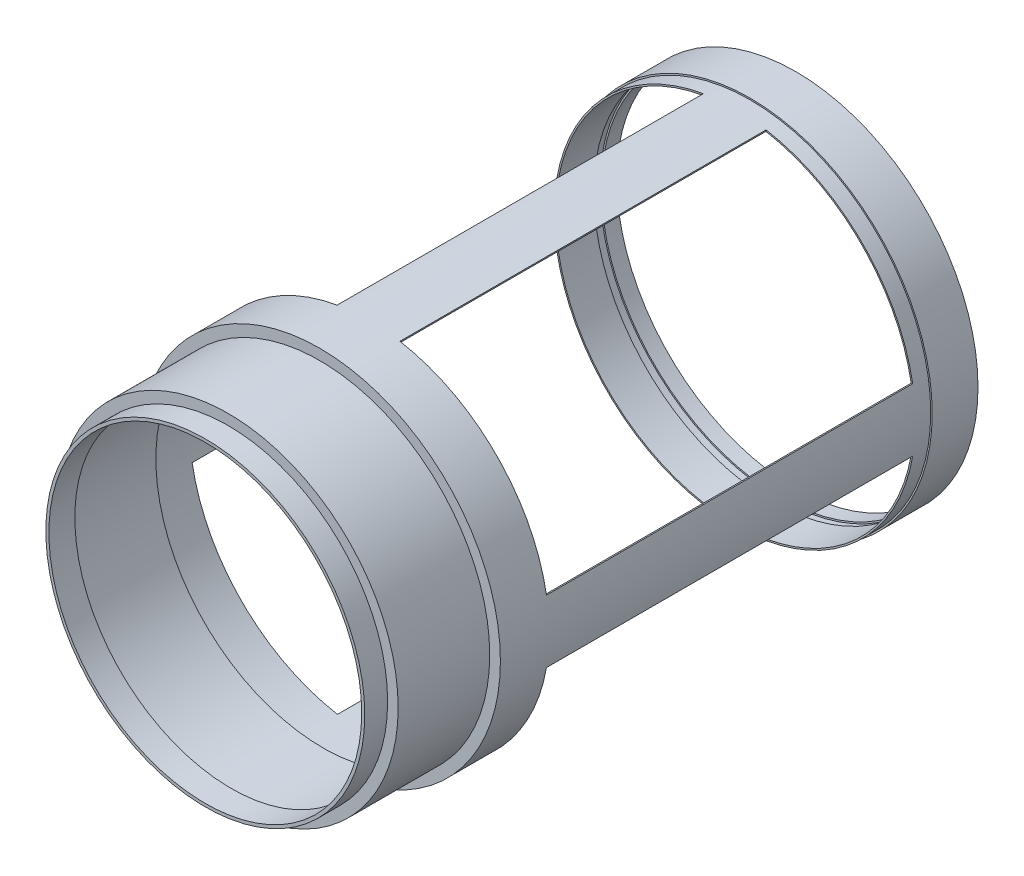
ISO-10303-21;
HEADER;
FILE_DESCRIPTION(('STEP AP214'),'2;1');
FILE_NAME('part.step','',(''),(''),'','','');
FILE_SCHEMA(('AUTOMOTIVE_DESIGN { 1 0 10303 214 1 1 1 1 }'));
ENDSEC;
DATA;
#1=APPLICATION_CONTEXT('core data for automotive mechanical design processes');
#2=APPLICATION_PROTOCOL_DEFINITION('international standard','automotive_design',2000,#1);
#3=PRODUCT_CONTEXT('',#1,'mechanical');
#4=PRODUCT('Part','Part','',(#3));
#5=PRODUCT_RELATED_PRODUCT_CATEGORY('part','',(#4));
#6=PRODUCT_DEFINITION_FORMATION('','',#4);
#7=PRODUCT_DEFINITION_CONTEXT('part definition',#1,'design');
#8=PRODUCT_DEFINITION('design','',#6,#7);
#9=PRODUCT_DEFINITION_SHAPE('','',#8);
#10=(LENGTH_UNIT() NAMED_UNIT(*) SI_UNIT(.MILLI.,.METRE.));
#11=(NAMED_UNIT(*) PLANE_ANGLE_UNIT() SI_UNIT($,.RADIAN.));
#12=(NAMED_UNIT(*) SI_UNIT($,.STERADIAN.) SOLID_ANGLE_UNIT());
#13=UNCERTAINTY_MEASURE_WITH_UNIT(LENGTH_MEASURE(1.E-05),#10,'distance_accuracy_value','');
#14=(GEOMETRIC_REPRESENTATION_CONTEXT(3) GLOBAL_UNCERTAINTY_ASSIGNED_CONTEXT((#13)) GLOBAL_UNIT_ASSIGNED_CONTEXT((#10,
#11,#12)) REPRESENTATION_CONTEXT('',''));
#15=CARTESIAN_POINT('',(0.,0.,0.));
#16=DIRECTION('',(0.,0.,1.));
#17=DIRECTION('',(1.,0.,0.));
#18=AXIS2_PLACEMENT_3D('',#15,#16,#17);
#19=CARTESIAN_POINT('',(0.,0.,372.));
#20=DIRECTION('',(0.,0.,1.));
#21=DIRECTION('',(1.,0.,0.));
#22=AXIS2_PLACEMENT_3D('',#19,#20,#21);
#23=PLANE('',#22);
#24=CARTESIAN_POINT('',(0.,0.,372.));
#25=DIRECTION('',(0.,0.,1.));
#26=DIRECTION('',(1.,0.,0.));
#27=AXIS2_PLACEMENT_3D('',#24,#25,#26);
#28=CIRCLE('',#27,111.4);
#29=CARTESIAN_POINT('',(111.4,0.,372.));
#30=VERTEX_POINT('',#29);
#31=EDGE_CURVE('E197',#30,#30,#28,.T.);
#32=ORIENTED_EDGE('',*,*,#31,.T.);
#33=EDGE_LOOP('',(#32));
#34=FACE_BOUND('',#33,.T.);
#35=CARTESIAN_POINT('',(0.,0.,372.));
#36=DIRECTION('',(0.,0.,1.));
#37=DIRECTION('',(1.,0.,0.));
#38=AXIS2_PLACEMENT_3D('',#35,#36,#37);
#39=CIRCLE('',#38,104.5);
#40=CARTESIAN_POINT('',(104.5,0.,372.));
#41=VERTEX_POINT('',#40);
#42=EDGE_CURVE('E210',#41,#41,#39,.T.);
#43=ORIENTED_EDGE('',*,*,#42,.F.);
#44=EDGE_LOOP('',(#43));
#45=FACE_BOUND('',#44,.T.);
#46=ADVANCED_FACE('F30',(#34,#45),#23,.T.);
#47=CARTESIAN_POINT('',(0.,0.,312.));
#48=DIRECTION('',(0.,0.,-1.));
#49=DIRECTION('',(-1.,0.,0.));
#50=AXIS2_PLACEMENT_3D('',#47,#48,#49);
#51=CYLINDRICAL_SURFACE('',#50,109.4);
#52=CARTESIAN_POINT('',(0.,0.,310.));
#53=DIRECTION('',(0.,0.,1.));
#54=DIRECTION('',(1.,0.,0.));
#55=AXIS2_PLACEMENT_3D('',#52,#53,#54);
#56=CIRCLE('',#55,109.4);
#57=CARTESIAN_POINT('',(109.4,0.,310.));
#58=VERTEX_POINT('',#57);
#59=EDGE_CURVE('E192',#58,#58,#56,.T.);
#60=ORIENTED_EDGE('',*,*,#59,.F.);
#61=EDGE_LOOP('',(#60));
#62=FACE_BOUND('',#61,.T.);
#63=CARTESIAN_POINT('',(0.,0.,370.));
#64=DIRECTION('',(0.,0.,1.));
#65=DIRECTION('',(1.,0.,0.));
#66=AXIS2_PLACEMENT_3D('',#63,#64,#65);
#67=CIRCLE('',#66,109.4);
#68=CARTESIAN_POINT('',(109.4,0.,370.));
#69=VERTEX_POINT('',#68);
#70=EDGE_CURVE('E201',#69,#69,#67,.T.);
#71=ORIENTED_EDGE('',*,*,#70,.T.);
#72=EDGE_LOOP('',(#71));
#73=FACE_BOUND('',#72,.T.);
#74=ADVANCED_FACE('F236',(#62,#73),#51,.F.);
#75=CARTESIAN_POINT('',(0.,0.,312.));
#76=DIRECTION('',(0.,0.,1.));
#77=DIRECTION('',(1.,0.,0.));
#78=AXIS2_PLACEMENT_3D('',#75,#76,#77);
#79=PLANE('',#78);
#80=CARTESIAN_POINT('',(0.,0.,312.));
#81=DIRECTION('',(0.,0.,1.));
#82=DIRECTION('',(1.,0.,0.));
#83=AXIS2_PLACEMENT_3D('',#80,#81,#82);
#84=CIRCLE('',#83,118.4);
#85=CARTESIAN_POINT('',(118.4,0.,312.));
#86=VERTEX_POINT('',#85);
#87=EDGE_CURVE('E189',#86,#86,#84,.T.);
#88=ORIENTED_EDGE('',*,*,#87,.T.);
#89=EDGE_LOOP('',(#88));
#90=FACE_BOUND('',#89,.T.);
#91=CARTESIAN_POINT('',(0.,0.,312.));
#92=DIRECTION('',(0.,0.,1.));
#93=DIRECTION('',(1.,0.,0.));
#94=AXIS2_PLACEMENT_3D('',#91,#92,#93);
#95=CIRCLE('',#94,111.4);
#96=CARTESIAN_POINT('',(111.4,0.,312.));
#97=VERTEX_POINT('',#96);
#98=EDGE_CURVE('E198',#97,#97,#95,.T.);
#99=ORIENTED_EDGE('',*,*,#98,.F.);
#100=EDGE_LOOP('',(#99));
#101=FACE_BOUND('',#100,.T.);
#102=ADVANCED_FACE('F242',(#90,#101),#79,.T.);
#103=CARTESIAN_POINT('',(0.,0.,40.));
#104=DIRECTION('',(0.,0.,1.));
#105=DIRECTION('',(1.,0.,0.));
#106=AXIS2_PLACEMENT_3D('',#103,#104,#105);
#107=PLANE('',#106);
#108=CARTESIAN_POINT('',(0.,0.,40.));
#109=DIRECTION('',(0.,0.,1.));
#110=DIRECTION('',(1.,0.,0.));
#111=AXIS2_PLACEMENT_3D('',#108,#109,#110);
#112=CIRCLE('',#111,117.4);
#113=CARTESIAN_POINT('',(-20.3862960580977,115.616430203633,40.));
#114=VERTEX_POINT('',#113);
#115=CARTESIAN_POINT('',(-115.616430203633,20.3862960580977,40.));
#116=VERTEX_POINT('',#115);
#117=EDGE_CURVE('E34',#114,#116,#112,.T.);
#118=ORIENTED_EDGE('',*,*,#117,.F.);
#119=DIRECTION('',(0.17364817766695,-0.984807753012205,0.));
#120=VECTOR('',#119,1.);
#121=CARTESIAN_POINT('',(-20.5599442357647,116.601237956645,40.));
#122=LINE('',#121,#120);
#123=CARTESIAN_POINT('',(-20.5599442357647,116.601237956645,40.));
#124=VERTEX_POINT('',#123);
#125=EDGE_CURVE('E469',#124,#114,#122,.T.);
#126=ORIENTED_EDGE('',*,*,#125,.F.);
#127=CARTESIAN_POINT('',(0.,0.,40.));
#128=DIRECTION('',(0.,0.,1.));
#129=DIRECTION('',(1.,0.,0.));
#130=AXIS2_PLACEMENT_3D('',#127,#128,#129);
#131=CIRCLE('',#130,118.4);
#132=CARTESIAN_POINT('',(-116.601237956645,20.5599442357646,40.));
#133=VERTEX_POINT('',#132);
#134=EDGE_CURVE('E352',#124,#133,#131,.T.);
#135=ORIENTED_EDGE('',*,*,#134,.T.);
#136=DIRECTION('',(-0.984807753012205,0.173648177666948,0.));
#137=VECTOR('',#136,1.);
#138=CARTESIAN_POINT('',(-115.616430203633,20.3862960580977,40.));
#139=LINE('',#138,#137);
#140=EDGE_CURVE('E455',#116,#133,#139,.T.);
#141=ORIENTED_EDGE('',*,*,#140,.F.);
#142=EDGE_LOOP('',(#118,#126,#135,#141));
#143=FACE_BOUND('',#142,.T.);
#144=ADVANCED_FACE('F255',(#143),#107,.T.);
#145=CARTESIAN_POINT('',(116.601237956645,20.5599442357647,40.));
#146=VERTEX_POINT('',#145);
#147=CARTESIAN_POINT('',(20.5599442357646,116.601237956645,40.));
#148=VERTEX_POINT('',#147);
#149=EDGE_CURVE('E349',#146,#148,#131,.T.);
#150=ORIENTED_EDGE('',*,*,#149,.T.);
#151=DIRECTION('',(0.17364817766693,0.984807753012208,0.));
#152=VECTOR('',#151,1.);
#153=CARTESIAN_POINT('',(20.5599442357646,116.601237956645,40.));
#154=LINE('',#153,#152);
#155=CARTESIAN_POINT('',(20.3862960580977,115.616430203633,40.));
#156=VERTEX_POINT('',#155);
#157=EDGE_CURVE('E55',#156,#148,#154,.T.);
#158=ORIENTED_EDGE('',*,*,#157,.F.);
#159=CARTESIAN_POINT('',(115.616430203633,20.3862960580977,40.));
#160=VERTEX_POINT('',#159);
#161=EDGE_CURVE('E164',#160,#156,#112,.T.);
#162=ORIENTED_EDGE('',*,*,#161,.F.);
#163=DIRECTION('',(-0.984807753012208,-0.17364817766693,0.));
#164=VECTOR('',#163,1.);
#165=CARTESIAN_POINT('',(116.601237956645,20.5599442357647,40.));
#166=LINE('',#165,#164);
#167=EDGE_CURVE('E369',#146,#160,#166,.T.);
#168=ORIENTED_EDGE('',*,*,#167,.F.);
#169=EDGE_LOOP('',(#150,#158,#162,#168));
#170=FACE_BOUND('',#169,.T.);
#171=ADVANCED_FACE('F489',(#170),#107,.T.);
#172=CARTESIAN_POINT('',(-115.616430203633,-20.3862960580977,40.));
#173=VERTEX_POINT('',#172);
#174=CARTESIAN_POINT('',(-20.3862960580977,-115.616430203633,40.));
#175=VERTEX_POINT('',#174);
#176=EDGE_CURVE('E366',#173,#175,#112,.T.);
#177=ORIENTED_EDGE('',*,*,#176,.F.);
#178=DIRECTION('',(0.984807753012208,0.173648177666933,0.));
#179=VECTOR('',#178,1.);
#180=CARTESIAN_POINT('',(-115.616430203633,-20.3862960580977,40.));
#181=LINE('',#180,#179);
#182=CARTESIAN_POINT('',(-116.601237956645,-20.5599442357647,40.));
#183=VERTEX_POINT('',#182);
#184=EDGE_CURVE('E451',#183,#173,#181,.T.);
#185=ORIENTED_EDGE('',*,*,#184,.F.);
#186=CARTESIAN_POINT('',(-20.5599442357646,-116.601237956645,40.));
#187=VERTEX_POINT('',#186);
#188=EDGE_CURVE('E363',#183,#187,#131,.T.);
#189=ORIENTED_EDGE('',*,*,#188,.T.);
#190=DIRECTION('',(-0.17364817766693,-0.984807753012208,0.));
#191=VECTOR('',#190,1.);
#192=CARTESIAN_POINT('',(-20.5599442357646,-116.601237956645,40.));
#193=LINE('',#192,#191);
#194=EDGE_CURVE('E430',#175,#187,#193,.T.);
#195=ORIENTED_EDGE('',*,*,#194,.F.);
#196=EDGE_LOOP('',(#177,#185,#189,#195));
#197=FACE_BOUND('',#196,.T.);
#198=ADVANCED_FACE('F299',(#197),#107,.T.);
#199=CARTESIAN_POINT('',(20.3862960580977,-115.616430203633,40.));
#200=VERTEX_POINT('',#199);
#201=CARTESIAN_POINT('',(115.616430203633,-20.3862960580977,40.));
#202=VERTEX_POINT('',#201);
#203=EDGE_CURVE('E365',#200,#202,#112,.T.);
#204=ORIENTED_EDGE('',*,*,#203,.F.);
#205=DIRECTION('',(-0.173648177666957,0.984807753012203,0.));
#206=VECTOR('',#205,1.);
#207=CARTESIAN_POINT('',(20.5599442357647,-116.601237956645,40.));
#208=LINE('',#207,#206);
#209=CARTESIAN_POINT('',(20.5599442357647,-116.601237956645,40.));
#210=VERTEX_POINT('',#209);
#211=EDGE_CURVE('E433',#210,#200,#208,.T.);
#212=ORIENTED_EDGE('',*,*,#211,.F.);
#213=CARTESIAN_POINT('',(116.601237956645,-20.5599442357646,40.));
#214=VERTEX_POINT('',#213);
#215=EDGE_CURVE('E359',#210,#214,#131,.T.);
#216=ORIENTED_EDGE('',*,*,#215,.T.);
#217=DIRECTION('',(0.984807753012208,-0.17364817766693,0.));
#218=VECTOR('',#217,1.);
#219=CARTESIAN_POINT('',(116.601237956645,-20.5599442357646,40.));
#220=LINE('',#219,#218);
#221=EDGE_CURVE('E376',#202,#214,#220,.T.);
#222=ORIENTED_EDGE('',*,*,#221,.F.);
#223=EDGE_LOOP('',(#204,#212,#216,#222));
#224=FACE_BOUND('',#223,.T.);
#225=ADVANCED_FACE('F295',(#224),#107,.T.);
#226=CARTESIAN_POINT('',(0.,0.,30.));
#227=DIRECTION('',(0.,0.,1.));
#228=DIRECTION('',(1.,0.,0.));
#229=AXIS2_PLACEMENT_3D('',#226,#227,#228);
#230=PLANE('',#229);
#231=CARTESIAN_POINT('',(0.,0.,30.));
#232=DIRECTION('',(0.,0.,1.));
#233=DIRECTION('',(1.,0.,0.));
#234=AXIS2_PLACEMENT_3D('',#231,#232,#233);
#235=CIRCLE('',#234,119.4);
#236=CARTESIAN_POINT('',(119.4,0.,30.));
#237=VERTEX_POINT('',#236);
#238=EDGE_CURVE('E345',#237,#237,#235,.T.);
#239=ORIENTED_EDGE('',*,*,#238,.T.);
#240=EDGE_LOOP('',(#239));
#241=FACE_BOUND('',#240,.T.);
#242=CARTESIAN_POINT('',(0.,0.,30.));
#243=DIRECTION('',(0.,0.,1.));
#244=DIRECTION('',(1.,0.,0.));
#245=AXIS2_PLACEMENT_3D('',#242,#243,#244);
#246=CIRCLE('',#245,118.4);
#247=CARTESIAN_POINT('',(118.4,0.,30.));
#248=VERTEX_POINT('',#247);
#249=EDGE_CURVE('E387',#248,#248,#246,.T.);
#250=ORIENTED_EDGE('',*,*,#249,.F.);
#251=EDGE_LOOP('',(#250));
#252=FACE_BOUND('',#251,.T.);
#253=ADVANCED_FACE('F298',(#241,#252),#230,.T.);
#254=CARTESIAN_POINT('',(0.,0.,10.));
#255=DIRECTION('',(0.,0.,1.));
#256=DIRECTION('',(1.,0.,0.));
#257=AXIS2_PLACEMENT_3D('',#254,#255,#256);
#258=PLANE('',#257);
#259=CARTESIAN_POINT('',(0.,0.,10.));
#260=DIRECTION('',(0.,0.,1.));
#261=DIRECTION('',(1.,0.,0.));
#262=AXIS2_PLACEMENT_3D('',#259,#260,#261);
#263=CIRCLE('',#262,118.4);
#264=CARTESIAN_POINT('',(118.4,0.,10.));
#265=VERTEX_POINT('',#264);
#266=EDGE_CURVE('E11',#265,#265,#263,.F.);
#267=ORIENTED_EDGE('',*,*,#266,.F.);
#268=EDGE_LOOP('',(#267));
#269=FACE_BOUND('',#268,.T.);
#270=CARTESIAN_POINT('',(0.,0.,10.));
#271=DIRECTION('',(0.,0.,1.));
#272=DIRECTION('',(1.,0.,0.));
#273=AXIS2_PLACEMENT_3D('',#270,#271,#272);
#274=CIRCLE('',#273,117.4);
#275=CARTESIAN_POINT('',(117.4,0.,10.));
#276=VERTEX_POINT('',#275);
#277=EDGE_CURVE('E339',#276,#276,#274,.T.);
#278=ORIENTED_EDGE('',*,*,#277,.F.);
#279=EDGE_LOOP('',(#278));
#280=FACE_BOUND('',#279,.T.);
#281=ADVANCED_FACE('F310',(#269,#280),#258,.T.);
#282=CARTESIAN_POINT('',(0.,0.,0.));
#283=DIRECTION('',(0.,0.,1.));
#284=DIRECTION('',(1.,0.,0.));
#285=AXIS2_PLACEMENT_3D('',#282,#283,#284);
#286=PLANE('',#285);
#287=CARTESIAN_POINT('',(0.,0.,0.));
#288=DIRECTION('',(0.,0.,1.));
#289=DIRECTION('',(1.,0.,0.));
#290=AXIS2_PLACEMENT_3D('',#287,#288,#289);
#291=CIRCLE('',#290,119.4);
#292=CARTESIAN_POINT('',(119.4,0.,0.));
#293=VERTEX_POINT('',#292);
#294=EDGE_CURVE('E40',#293,#293,#291,.T.);
#295=ORIENTED_EDGE('',*,*,#294,.F.);
#296=EDGE_LOOP('',(#295));
#297=FACE_BOUND('',#296,.T.);
#298=CARTESIAN_POINT('',(0.,0.,0.));
#299=DIRECTION('',(0.,0.,1.));
#300=DIRECTION('',(1.,0.,0.));
#301=AXIS2_PLACEMENT_3D('',#298,#299,#300);
#302=CIRCLE('',#301,117.4);
#303=CARTESIAN_POINT('',(117.4,0.,0.));
#304=VERTEX_POINT('',#303);
#305=EDGE_CURVE('E337',#304,#304,#302,.T.);
#306=ORIENTED_EDGE('',*,*,#305,.T.);
#307=EDGE_LOOP('',(#306));
#308=FACE_BOUND('',#307,.T.);
#309=ADVANCED_FACE('F324',(#297,#308),#286,.F.);
#310=CARTESIAN_POINT('',(0.,0.,10.));
#311=DIRECTION('',(0.,0.,-1.));
#312=DIRECTION('',(-1.,0.,0.));
#313=AXIS2_PLACEMENT_3D('',#310,#311,#312);
#314=CYLINDRICAL_SURFACE('',#313,119.4);
#315=ORIENTED_EDGE('',*,*,#294,.T.);
#316=EDGE_LOOP('',(#315));
#317=FACE_BOUND('',#316,.T.);
#318=ORIENTED_EDGE('',*,*,#238,.F.);
#319=EDGE_LOOP('',(#318));
#320=FACE_BOUND('',#319,.T.);
#321=ADVANCED_FACE('F32',(#317,#320),#314,.T.);
#322=CARTESIAN_POINT('',(0.,0.,10.));
#323=DIRECTION('',(0.,0.,-1.));
#324=DIRECTION('',(-1.,0.,0.));
#325=AXIS2_PLACEMENT_3D('',#322,#323,#324);
#326=CYLINDRICAL_SURFACE('',#325,117.4);
#327=ORIENTED_EDGE('',*,*,#277,.T.);
#328=EDGE_LOOP('',(#327));
#329=FACE_BOUND('',#328,.T.);
#330=ORIENTED_EDGE('',*,*,#305,.F.);
#331=EDGE_LOOP('',(#330));
#332=FACE_BOUND('',#331,.T.);
#333=ADVANCED_FACE('F318',(#329,#332),#326,.F.);
#334=CARTESIAN_POINT('',(0.,0.,15.));
#335=DIRECTION('',(0.,0.,-1.));
#336=DIRECTION('',(-1.,0.,0.));
#337=AXIS2_PLACEMENT_3D('',#334,#335,#336);
#338=CYLINDRICAL_SURFACE('',#337,118.4);
#339=CARTESIAN_POINT('',(0.,0.,15.));
#340=DIRECTION('',(0.,0.,1.));
#341=DIRECTION('',(1.,0.,0.));
#342=AXIS2_PLACEMENT_3D('',#339,#340,#341);
#343=CIRCLE('',#342,118.4);
#344=CARTESIAN_POINT('',(118.4,0.,15.));
#345=VERTEX_POINT('',#344);
#346=EDGE_CURVE('E340',#345,#345,#343,.T.);
#347=ORIENTED_EDGE('',*,*,#346,.T.);
#348=EDGE_LOOP('',(#347));
#349=FACE_BOUND('',#348,.T.);
#350=ORIENTED_EDGE('',*,*,#266,.T.);
#351=EDGE_LOOP('',(#350));
#352=FACE_BOUND('',#351,.T.);
#353=ADVANCED_FACE('F314',(#349,#352),#338,.F.);
#354=CARTESIAN_POINT('',(0.,0.,15.));
#355=DIRECTION('',(0.,0.,1.));
#356=DIRECTION('',(1.,0.,0.));
#357=AXIS2_PLACEMENT_3D('',#354,#355,#356);
#358=PLANE('',#357);
#359=ORIENTED_EDGE('',*,*,#346,.F.);
#360=EDGE_LOOP('',(#359));
#361=FACE_BOUND('',#360,.T.);
#362=CARTESIAN_POINT('',(0.,0.,15.));
#363=DIRECTION('',(0.,0.,1.));
#364=DIRECTION('',(1.,0.,0.));
#365=AXIS2_PLACEMENT_3D('',#362,#363,#364);
#366=CIRCLE('',#365,117.4);
#367=CARTESIAN_POINT('',(117.4,0.,15.));
#368=VERTEX_POINT('',#367);
#369=EDGE_CURVE('E351',#368,#368,#366,.T.);
#370=ORIENTED_EDGE('',*,*,#369,.T.);
#371=EDGE_LOOP('',(#370));
#372=FACE_BOUND('',#371,.T.);
#373=ADVANCED_FACE('F306',(#361,#372),#358,.F.);
#374=CARTESIAN_POINT('',(0.,0.,30.));
#375=DIRECTION('',(0.,0.,-1.));
#376=DIRECTION('',(-1.,0.,0.));
#377=AXIS2_PLACEMENT_3D('',#374,#375,#376);
#378=CYLINDRICAL_SURFACE('',#377,117.4);
#379=DIRECTION('',(0.,0.,-1.));
#380=VECTOR('',#379,1.);
#381=CARTESIAN_POINT('',(115.616430203633,-20.3862960580977,280.));
#382=LINE('',#381,#380);
#383=CARTESIAN_POINT('',(115.616430203633,-20.3862960580977,280.));
#384=VERTEX_POINT('',#383);
#385=EDGE_CURVE('E398',#384,#202,#382,.T.);
#386=ORIENTED_EDGE('',*,*,#385,.F.);
#387=CARTESIAN_POINT('',(0.,0.,280.));
#388=DIRECTION('',(0.,0.,1.));
#389=DIRECTION('',(1.,0.,0.));
#390=AXIS2_PLACEMENT_3D('',#387,#388,#389);
#391=CIRCLE('',#390,117.4);
#392=CARTESIAN_POINT('',(20.3862960580977,-115.616430203633,280.));
#393=VERTEX_POINT('',#392);
#394=EDGE_CURVE('E173',#393,#384,#391,.T.);
#395=ORIENTED_EDGE('',*,*,#394,.F.);
#396=DIRECTION('',(0.,0.,-1.));
#397=VECTOR('',#396,1.);
#398=CARTESIAN_POINT('',(20.3862960580977,-115.616430203633,280.));
#399=LINE('',#398,#397);
#400=EDGE_CURVE('E411',#393,#200,#399,.T.);
#401=ORIENTED_EDGE('',*,*,#400,.T.);
#402=ORIENTED_EDGE('',*,*,#203,.T.);
#403=EDGE_LOOP('',(#386,#395,#401,#402));
#404=FACE_BOUND('',#403,.T.);
#405=DIRECTION('',(0.,0.,-1.));
#406=VECTOR('',#405,1.);
#407=CARTESIAN_POINT('',(-20.3862960580977,-115.616430203633,280.));
#408=LINE('',#407,#406);
#409=CARTESIAN_POINT('',(-20.3862960580977,-115.616430203633,280.));
#410=VERTEX_POINT('',#409);
#411=EDGE_CURVE('E423',#410,#175,#408,.T.);
#412=ORIENTED_EDGE('',*,*,#411,.F.);
#413=CARTESIAN_POINT('',(-115.616430203633,-20.3862960580977,280.));
#414=VERTEX_POINT('',#413);
#415=EDGE_CURVE('E179',#414,#410,#391,.T.);
#416=ORIENTED_EDGE('',*,*,#415,.F.);
#417=DIRECTION('',(0.,0.,-1.));
#418=VECTOR('',#417,1.);
#419=CARTESIAN_POINT('',(-115.616430203633,-20.3862960580977,280.));
#420=LINE('',#419,#418);
#421=EDGE_CURVE('E447',#414,#173,#420,.T.);
#422=ORIENTED_EDGE('',*,*,#421,.T.);
#423=ORIENTED_EDGE('',*,*,#176,.T.);
#424=EDGE_LOOP('',(#412,#416,#422,#423));
#425=FACE_BOUND('',#424,.T.);
#426=DIRECTION('',(0.,0.,-1.));
#427=VECTOR('',#426,1.);
#428=CARTESIAN_POINT('',(-115.616430203633,20.3862960580977,280.));
#429=LINE('',#428,#427);
#430=CARTESIAN_POINT('',(-115.616430203633,20.3862960580977,280.));
#431=VERTEX_POINT('',#430);
#432=EDGE_CURVE('E435',#431,#116,#429,.T.);
#433=ORIENTED_EDGE('',*,*,#432,.F.);
#434=CARTESIAN_POINT('',(-20.3862960580977,115.616430203633,280.));
#435=VERTEX_POINT('',#434);
#436=EDGE_CURVE('E171',#435,#431,#391,.T.);
#437=ORIENTED_EDGE('',*,*,#436,.F.);
#438=DIRECTION('',(0.,0.,-1.));
#439=VECTOR('',#438,1.);
#440=CARTESIAN_POINT('',(-20.3862960580977,115.616430203633,280.));
#441=LINE('',#440,#439);
#442=EDGE_CURVE('E165',#435,#114,#441,.T.);
#443=ORIENTED_EDGE('',*,*,#442,.T.);
#444=ORIENTED_EDGE('',*,*,#117,.T.);
#445=EDGE_LOOP('',(#433,#437,#443,#444));
#446=FACE_BOUND('',#445,.T.);
#447=ORIENTED_EDGE('',*,*,#369,.F.);
#448=EDGE_LOOP('',(#447));
#449=FACE_BOUND('',#448,.T.);
#450=ORIENTED_EDGE('',*,*,#161,.T.);
#451=DIRECTION('',(0.,0.,-1.));
#452=VECTOR('',#451,1.);
#453=CARTESIAN_POINT('',(20.3862960580977,115.616430203633,280.));
#454=LINE('',#453,#452);
#455=CARTESIAN_POINT('',(20.3862960580977,115.616430203633,280.));
#456=VERTEX_POINT('',#455);
#457=EDGE_CURVE('E149',#456,#156,#454,.T.);
#458=ORIENTED_EDGE('',*,*,#457,.F.);
#459=CARTESIAN_POINT('',(115.616430203633,20.3862960580977,280.));
#460=VERTEX_POINT('',#459);
#461=EDGE_CURVE('E163',#460,#456,#391,.T.);
#462=ORIENTED_EDGE('',*,*,#461,.F.);
#463=DIRECTION('',(0.,0.,-1.));
#464=VECTOR('',#463,1.);
#465=CARTESIAN_POINT('',(115.616430203633,20.3862960580977,280.));
#466=LINE('',#465,#464);
#467=EDGE_CURVE('E378',#460,#160,#466,.T.);
#468=ORIENTED_EDGE('',*,*,#467,.T.);
#469=EDGE_LOOP('',(#450,#458,#462,#468));
#470=FACE_BOUND('',#469,.T.);
#471=CARTESIAN_POINT('',(0.,0.,310.));
#472=DIRECTION('',(0.,0.,1.));
#473=DIRECTION('',(1.,0.,0.));
#474=AXIS2_PLACEMENT_3D('',#471,#472,#473);
#475=CIRCLE('',#474,117.4);
#476=CARTESIAN_POINT('',(117.4,0.,310.));
#477=VERTEX_POINT('',#476);
#478=EDGE_CURVE('E182',#477,#477,#475,.T.);
#479=ORIENTED_EDGE('',*,*,#478,.T.);
#480=EDGE_LOOP('',(#479));
#481=FACE_BOUND('',#480,.T.);
#482=ADVANCED_FACE('F160',(#404,#425,#446,#449,#470,#481),#378,.F.);
#483=CARTESIAN_POINT('',(0.,0.,40.));
#484=DIRECTION('',(0.,0.,-1.));
#485=DIRECTION('',(-1.,0.,0.));
#486=AXIS2_PLACEMENT_3D('',#483,#484,#485);
#487=CYLINDRICAL_SURFACE('',#486,118.4);
#488=DIRECTION('',(0.,0.,-1.));
#489=VECTOR('',#488,1.);
#490=CARTESIAN_POINT('',(116.601237956645,20.5599442357647,280.));
#491=LINE('',#490,#489);
#492=CARTESIAN_POINT('',(116.601237956645,20.5599442357647,280.));
#493=VERTEX_POINT('',#492);
#494=EDGE_CURVE('E404',#493,#146,#491,.T.);
#495=ORIENTED_EDGE('',*,*,#494,.F.);
#496=CARTESIAN_POINT('',(0.,0.,280.));
#497=DIRECTION('',(0.,0.,1.));
#498=DIRECTION('',(1.,0.,0.));
#499=AXIS2_PLACEMENT_3D('',#496,#497,#498);
#500=CIRCLE('',#499,118.4);
#501=CARTESIAN_POINT('',(20.5599442357646,116.601237956645,280.));
#502=VERTEX_POINT('',#501);
#503=EDGE_CURVE('E177',#493,#502,#500,.T.);
#504=ORIENTED_EDGE('',*,*,#503,.T.);
#505=DIRECTION('',(0.,0.,-1.));
#506=VECTOR('',#505,1.);
#507=CARTESIAN_POINT('',(20.5599442357646,116.601237956645,280.));
#508=LINE('',#507,#506);
#509=EDGE_CURVE('E151',#502,#148,#508,.T.);
#510=ORIENTED_EDGE('',*,*,#509,.T.);
#511=ORIENTED_EDGE('',*,*,#149,.F.);
#512=EDGE_LOOP('',(#495,#504,#510,#511));
#513=FACE_BOUND('',#512,.T.);
#514=DIRECTION('',(0.,0.,-1.));
#515=VECTOR('',#514,1.);
#516=CARTESIAN_POINT('',(20.5599442357647,-116.601237956645,280.));
#517=LINE('',#516,#515);
#518=CARTESIAN_POINT('',(20.5599442357647,-116.601237956645,280.));
#519=VERTEX_POINT('',#518);
#520=EDGE_CURVE('E377',#519,#210,#517,.T.);
#521=ORIENTED_EDGE('',*,*,#520,.F.);
#522=CARTESIAN_POINT('',(116.601237956645,-20.5599442357646,280.));
#523=VERTEX_POINT('',#522);
#524=EDGE_CURVE('E170',#519,#523,#500,.T.);
#525=ORIENTED_EDGE('',*,*,#524,.T.);
#526=DIRECTION('',(0.,0.,-1.));
#527=VECTOR('',#526,1.);
#528=CARTESIAN_POINT('',(116.601237956645,-20.5599442357646,280.));
#529=LINE('',#528,#527);
#530=EDGE_CURVE('E395',#523,#214,#529,.T.);
#531=ORIENTED_EDGE('',*,*,#530,.T.);
#532=ORIENTED_EDGE('',*,*,#215,.F.);
#533=EDGE_LOOP('',(#521,#525,#531,#532));
#534=FACE_BOUND('',#533,.T.);
#535=DIRECTION('',(0.,0.,-1.));
#536=VECTOR('',#535,1.);
#537=CARTESIAN_POINT('',(-116.601237956645,-20.5599442357647,280.));
#538=LINE('',#537,#536);
#539=CARTESIAN_POINT('',(-116.601237956645,-20.5599442357647,280.));
#540=VERTEX_POINT('',#539);
#541=EDGE_CURVE('E444',#540,#183,#538,.T.);
#542=ORIENTED_EDGE('',*,*,#541,.F.);
#543=CARTESIAN_POINT('',(-20.5599442357646,-116.601237956645,280.));
#544=VERTEX_POINT('',#543);
#545=EDGE_CURVE('E175',#540,#544,#500,.T.);
#546=ORIENTED_EDGE('',*,*,#545,.T.);
#547=DIRECTION('',(0.,0.,-1.));
#548=VECTOR('',#547,1.);
#549=CARTESIAN_POINT('',(-20.5599442357646,-116.601237956645,280.));
#550=LINE('',#549,#548);
#551=EDGE_CURVE('E426',#544,#187,#550,.T.);
#552=ORIENTED_EDGE('',*,*,#551,.T.);
#553=ORIENTED_EDGE('',*,*,#188,.F.);
#554=EDGE_LOOP('',(#542,#546,#552,#553));
#555=FACE_BOUND('',#554,.T.);
#556=CARTESIAN_POINT('',(-20.5599442357647,116.601237956645,280.));
#557=VERTEX_POINT('',#556);
#558=CARTESIAN_POINT('',(-116.601237956645,20.5599442357646,280.));
#559=VERTEX_POINT('',#558);
#560=EDGE_CURVE('E472',#557,#559,#500,.T.);
#561=ORIENTED_EDGE('',*,*,#560,.T.);
#562=DIRECTION('',(0.,0.,-1.));
#563=VECTOR('',#562,1.);
#564=CARTESIAN_POINT('',(-116.601237956645,20.5599442357646,280.));
#565=LINE('',#564,#563);
#566=EDGE_CURVE('E441',#559,#133,#565,.T.);
#567=ORIENTED_EDGE('',*,*,#566,.T.);
#568=ORIENTED_EDGE('',*,*,#134,.F.);
#569=DIRECTION('',(0.,0.,-1.));
#570=VECTOR('',#569,1.);
#571=CARTESIAN_POINT('',(-20.5599442357647,116.601237956645,280.));
#572=LINE('',#571,#570);
#573=EDGE_CURVE('E458',#557,#124,#572,.T.);
#574=ORIENTED_EDGE('',*,*,#573,.F.);
#575=EDGE_LOOP('',(#561,#567,#568,#574));
#576=FACE_BOUND('',#575,.T.);
#577=ORIENTED_EDGE('',*,*,#249,.T.);
#578=EDGE_LOOP('',(#577));
#579=FACE_BOUND('',#578,.T.);
#580=ORIENTED_EDGE('',*,*,#87,.F.);
#581=EDGE_LOOP('',(#580));
#582=FACE_BOUND('',#581,.T.);
#583=ADVANCED_FACE('F293',(#513,#534,#555,#576,#579,#582),#487,.T.);
#584=CARTESIAN_POINT('',(116.601237956645,20.5599442357647,280.));
#585=DIRECTION('',(0.17364817766693,-0.984807753012208,0.));
#586=DIRECTION('',(0.984807753012208,0.17364817766693,0.));
#587=AXIS2_PLACEMENT_3D('',#584,#585,#586);
#588=PLANE('',#587);
#589=ORIENTED_EDGE('',*,*,#167,.T.);
#590=ORIENTED_EDGE('',*,*,#467,.F.);
#591=DIRECTION('',(-0.984807753012208,-0.17364817766693,0.));
#592=VECTOR('',#591,1.);
#593=CARTESIAN_POINT('',(116.601237956645,20.5599442357647,280.));
#594=LINE('',#593,#592);
#595=EDGE_CURVE('E169',#493,#460,#594,.T.);
#596=ORIENTED_EDGE('',*,*,#595,.F.);
#597=ORIENTED_EDGE('',*,*,#494,.T.);
#598=EDGE_LOOP('',(#589,#590,#596,#597));
#599=FACE_BOUND('',#598,.T.);
#600=ADVANCED_FACE('F289',(#599),#588,.F.);
#601=CARTESIAN_POINT('',(116.601237956645,-20.5599442357646,280.));
#602=DIRECTION('',(0.17364817766693,0.984807753012208,0.));
#603=DIRECTION('',(-0.984807753012208,0.17364817766693,0.));
#604=AXIS2_PLACEMENT_3D('',#601,#602,#603);
#605=PLANE('',#604);
#606=ORIENTED_EDGE('',*,*,#221,.T.);
#607=ORIENTED_EDGE('',*,*,#530,.F.);
#608=DIRECTION('',(0.984807753012208,-0.17364817766693,0.));
#609=VECTOR('',#608,1.);
#610=CARTESIAN_POINT('',(116.601237956645,-20.5599442357646,280.));
#611=LINE('',#610,#609);
#612=EDGE_CURVE('E383',#384,#523,#611,.T.);
#613=ORIENTED_EDGE('',*,*,#612,.F.);
#614=ORIENTED_EDGE('',*,*,#385,.T.);
#615=EDGE_LOOP('',(#606,#607,#613,#614));
#616=FACE_BOUND('',#615,.T.);
#617=ADVANCED_FACE('F285',(#616),#605,.F.);
#618=CARTESIAN_POINT('',(20.5599442357647,-116.601237956645,280.));
#619=DIRECTION('',(-0.984807753012203,-0.173648177666957,0.));
#620=DIRECTION('',(0.173648177666957,-0.984807753012204,0.));
#621=AXIS2_PLACEMENT_3D('',#618,#619,#620);
#622=PLANE('',#621);
#623=ORIENTED_EDGE('',*,*,#211,.T.);
#624=ORIENTED_EDGE('',*,*,#400,.F.);
#625=DIRECTION('',(-0.173648177666957,0.984807753012203,0.));
#626=VECTOR('',#625,1.);
#627=CARTESIAN_POINT('',(20.5599442357647,-116.601237956645,280.));
#628=LINE('',#627,#626);
#629=EDGE_CURVE('E419',#519,#393,#628,.T.);
#630=ORIENTED_EDGE('',*,*,#629,.F.);
#631=ORIENTED_EDGE('',*,*,#520,.T.);
#632=EDGE_LOOP('',(#623,#624,#630,#631));
#633=FACE_BOUND('',#632,.T.);
#634=ADVANCED_FACE('F281',(#633),#622,.F.);
#635=CARTESIAN_POINT('',(-20.5599442357646,-116.601237956645,280.));
#636=DIRECTION('',(0.984807753012208,-0.17364817766693,0.));
#637=DIRECTION('',(0.17364817766693,0.984807753012208,0.));
#638=AXIS2_PLACEMENT_3D('',#635,#636,#637);
#639=PLANE('',#638);
#640=ORIENTED_EDGE('',*,*,#194,.T.);
#641=ORIENTED_EDGE('',*,*,#551,.F.);
#642=DIRECTION('',(-0.17364817766693,-0.984807753012208,0.));
#643=VECTOR('',#642,1.);
#644=CARTESIAN_POINT('',(-20.5599442357646,-116.601237956645,280.));
#645=LINE('',#644,#643);
#646=EDGE_CURVE('E429',#410,#544,#645,.T.);
#647=ORIENTED_EDGE('',*,*,#646,.F.);
#648=ORIENTED_EDGE('',*,*,#411,.T.);
#649=EDGE_LOOP('',(#640,#641,#647,#648));
#650=FACE_BOUND('',#649,.T.);
#651=ADVANCED_FACE('F277',(#650),#639,.F.);
#652=CARTESIAN_POINT('',(-115.616430203633,20.3862960580977,280.));
#653=DIRECTION('',(-0.173648177666948,-0.984807753012205,0.));
#654=DIRECTION('',(0.984807753012205,-0.173648177666948,0.));
#655=AXIS2_PLACEMENT_3D('',#652,#653,#654);
#656=PLANE('',#655);
#657=ORIENTED_EDGE('',*,*,#140,.T.);
#658=ORIENTED_EDGE('',*,*,#566,.F.);
#659=DIRECTION('',(-0.984807753012205,0.173648177666948,0.));
#660=VECTOR('',#659,1.);
#661=CARTESIAN_POINT('',(-115.616430203633,20.3862960580977,280.));
#662=LINE('',#661,#660);
#663=EDGE_CURVE('E454',#431,#559,#662,.T.);
#664=ORIENTED_EDGE('',*,*,#663,.F.);
#665=ORIENTED_EDGE('',*,*,#432,.T.);
#666=EDGE_LOOP('',(#657,#658,#664,#665));
#667=FACE_BOUND('',#666,.T.);
#668=ADVANCED_FACE('F273',(#667),#656,.F.);
#669=CARTESIAN_POINT('',(-115.616430203633,-20.3862960580977,280.));
#670=DIRECTION('',(-0.173648177666933,0.984807753012207,0.));
#671=DIRECTION('',(-0.984807753012208,-0.173648177666933,0.));
#672=AXIS2_PLACEMENT_3D('',#669,#670,#671);
#673=PLANE('',#672);
#674=ORIENTED_EDGE('',*,*,#184,.T.);
#675=ORIENTED_EDGE('',*,*,#421,.F.);
#676=DIRECTION('',(0.984807753012208,0.173648177666933,0.));
#677=VECTOR('',#676,1.);
#678=CARTESIAN_POINT('',(-115.616430203633,-20.3862960580977,280.));
#679=LINE('',#678,#677);
#680=EDGE_CURVE('E450',#540,#414,#679,.T.);
#681=ORIENTED_EDGE('',*,*,#680,.F.);
#682=ORIENTED_EDGE('',*,*,#541,.T.);
#683=EDGE_LOOP('',(#674,#675,#681,#682));
#684=FACE_BOUND('',#683,.T.);
#685=ADVANCED_FACE('F269',(#684),#673,.F.);
#686=CARTESIAN_POINT('',(-20.5599442357647,116.601237956645,280.));
#687=DIRECTION('',(0.984807753012205,0.17364817766695,0.));
#688=DIRECTION('',(-0.17364817766695,0.984807753012205,0.));
#689=AXIS2_PLACEMENT_3D('',#686,#687,#688);
#690=PLANE('',#689);
#691=ORIENTED_EDGE('',*,*,#125,.T.);
#692=ORIENTED_EDGE('',*,*,#442,.F.);
#693=DIRECTION('',(0.17364817766695,-0.984807753012205,0.));
#694=VECTOR('',#693,1.);
#695=CARTESIAN_POINT('',(-20.5599442357647,116.601237956645,280.));
#696=LINE('',#695,#694);
#697=EDGE_CURVE('E156',#557,#435,#696,.T.);
#698=ORIENTED_EDGE('',*,*,#697,.F.);
#699=ORIENTED_EDGE('',*,*,#573,.T.);
#700=EDGE_LOOP('',(#691,#692,#698,#699));
#701=FACE_BOUND('',#700,.T.);
#702=ADVANCED_FACE('F266',(#701),#690,.F.);
#703=CARTESIAN_POINT('',(20.5599442357646,116.601237956645,280.));
#704=DIRECTION('',(-0.984807753012208,0.17364817766693,0.));
#705=DIRECTION('',(-0.17364817766693,-0.984807753012208,0.));
#706=AXIS2_PLACEMENT_3D('',#703,#704,#705);
#707=PLANE('',#706);
#708=ORIENTED_EDGE('',*,*,#157,.T.);
#709=ORIENTED_EDGE('',*,*,#509,.F.);
#710=DIRECTION('',(0.17364817766693,0.984807753012208,0.));
#711=VECTOR('',#710,1.);
#712=CARTESIAN_POINT('',(20.5599442357646,116.601237956645,280.));
#713=LINE('',#712,#711);
#714=EDGE_CURVE('E146',#456,#502,#713,.T.);
#715=ORIENTED_EDGE('',*,*,#714,.F.);
#716=ORIENTED_EDGE('',*,*,#457,.T.);
#717=EDGE_LOOP('',(#708,#709,#715,#716));
#718=FACE_BOUND('',#717,.T.);
#719=ADVANCED_FACE('F148',(#718),#707,.F.);
#720=CARTESIAN_POINT('',(0.,0.,280.));
#721=DIRECTION('',(0.,0.,1.));
#722=DIRECTION('',(1.,0.,0.));
#723=AXIS2_PLACEMENT_3D('',#720,#721,#722);
#724=PLANE('',#723);
#725=ORIENTED_EDGE('',*,*,#503,.F.);
#726=ORIENTED_EDGE('',*,*,#595,.T.);
#727=ORIENTED_EDGE('',*,*,#461,.T.);
#728=ORIENTED_EDGE('',*,*,#714,.T.);
#729=EDGE_LOOP('',(#725,#726,#727,#728));
#730=FACE_BOUND('',#729,.T.);
#731=ADVANCED_FACE('F168',(#730),#724,.F.);
#732=ORIENTED_EDGE('',*,*,#394,.T.);
#733=ORIENTED_EDGE('',*,*,#612,.T.);
#734=ORIENTED_EDGE('',*,*,#524,.F.);
#735=ORIENTED_EDGE('',*,*,#629,.T.);
#736=EDGE_LOOP('',(#732,#733,#734,#735));
#737=FACE_BOUND('',#736,.T.);
#738=ADVANCED_FACE('F263',(#737),#724,.F.);
#739=ORIENTED_EDGE('',*,*,#415,.T.);
#740=ORIENTED_EDGE('',*,*,#646,.T.);
#741=ORIENTED_EDGE('',*,*,#545,.F.);
#742=ORIENTED_EDGE('',*,*,#680,.T.);
#743=EDGE_LOOP('',(#739,#740,#741,#742));
#744=FACE_BOUND('',#743,.T.);
#745=ADVANCED_FACE('F481',(#744),#724,.F.);
#746=ORIENTED_EDGE('',*,*,#436,.T.);
#747=ORIENTED_EDGE('',*,*,#663,.T.);
#748=ORIENTED_EDGE('',*,*,#560,.F.);
#749=ORIENTED_EDGE('',*,*,#697,.T.);
#750=EDGE_LOOP('',(#746,#747,#748,#749));
#751=FACE_BOUND('',#750,.T.);
#752=ADVANCED_FACE('F259',(#751),#724,.F.);
#753=CARTESIAN_POINT('',(0.,0.,310.));
#754=DIRECTION('',(0.,0.,1.));
#755=DIRECTION('',(1.,0.,0.));
#756=AXIS2_PLACEMENT_3D('',#753,#754,#755);
#757=PLANE('',#756);
#758=ORIENTED_EDGE('',*,*,#478,.F.);
#759=EDGE_LOOP('',(#758));
#760=FACE_BOUND('',#759,.T.);
#761=ORIENTED_EDGE('',*,*,#59,.T.);
#762=EDGE_LOOP('',(#761));
#763=FACE_BOUND('',#762,.T.);
#764=ADVANCED_FACE('F250',(#760,#763),#757,.F.);
#765=CARTESIAN_POINT('',(0.,0.,372.));
#766=DIRECTION('',(0.,0.,-1.));
#767=DIRECTION('',(-1.,0.,0.));
#768=AXIS2_PLACEMENT_3D('',#765,#766,#767);
#769=CYLINDRICAL_SURFACE('',#768,111.4);
#770=ORIENTED_EDGE('',*,*,#31,.F.);
#771=EDGE_LOOP('',(#770));
#772=FACE_BOUND('',#771,.T.);
#773=ORIENTED_EDGE('',*,*,#98,.T.);
#774=EDGE_LOOP('',(#773));
#775=FACE_BOUND('',#774,.T.);
#776=ADVANCED_FACE('F248',(#772,#775),#769,.T.);
#777=CARTESIAN_POINT('',(0.,0.,370.));
#778=DIRECTION('',(0.,0.,1.));
#779=DIRECTION('',(1.,0.,0.));
#780=AXIS2_PLACEMENT_3D('',#777,#778,#779);
#781=PLANE('',#780);
#782=ORIENTED_EDGE('',*,*,#70,.F.);
#783=EDGE_LOOP('',(#782));
#784=FACE_BOUND('',#783,.T.);
#785=CARTESIAN_POINT('',(0.,0.,370.));
#786=DIRECTION('',(0.,0.,1.));
#787=DIRECTION('',(1.,0.,0.));
#788=AXIS2_PLACEMENT_3D('',#785,#786,#787);
#789=CIRCLE('',#788,102.5);
#790=CARTESIAN_POINT('',(102.5,0.,370.));
#791=VERTEX_POINT('',#790);
#792=EDGE_CURVE('E206',#791,#791,#789,.T.);
#793=ORIENTED_EDGE('',*,*,#792,.T.);
#794=EDGE_LOOP('',(#793));
#795=FACE_BOUND('',#794,.T.);
#796=ADVANCED_FACE('F232',(#784,#795),#781,.F.);
#797=CARTESIAN_POINT('',(0.,0.,370.));
#798=DIRECTION('',(0.,0.,1.));
#799=DIRECTION('',(1.,0.,0.));
#800=AXIS2_PLACEMENT_3D('',#797,#798,#799);
#801=CYLINDRICAL_SURFACE('',#800,102.5);
#802=ORIENTED_EDGE('',*,*,#792,.F.);
#803=EDGE_LOOP('',(#802));
#804=FACE_BOUND('',#803,.T.);
#805=CARTESIAN_POINT('',(0.,0.,387.));
#806=DIRECTION('',(0.,0.,1.));
#807=DIRECTION('',(1.,0.,0.));
#808=AXIS2_PLACEMENT_3D('',#805,#806,#807);
#809=CIRCLE('',#808,102.5);
#810=CARTESIAN_POINT('',(102.5,0.,387.));
#811=VERTEX_POINT('',#810);
#812=EDGE_CURVE('E213',#811,#811,#809,.T.);
#813=ORIENTED_EDGE('',*,*,#812,.T.);
#814=EDGE_LOOP('',(#813));
#815=FACE_BOUND('',#814,.T.);
#816=ADVANCED_FACE('F219',(#804,#815),#801,.F.);
#817=CARTESIAN_POINT('',(0.,0.,387.));
#818=DIRECTION('',(0.,0.,1.));
#819=DIRECTION('',(1.,0.,0.));
#820=AXIS2_PLACEMENT_3D('',#817,#818,#819);
#821=PLANE('',#820);
#822=CARTESIAN_POINT('',(0.,0.,387.));
#823=DIRECTION('',(0.,0.,1.));
#824=DIRECTION('',(1.,0.,0.));
#825=AXIS2_PLACEMENT_3D('',#822,#823,#824);
#826=CIRCLE('',#825,104.5);
#827=CARTESIAN_POINT('',(104.5,0.,387.));
#828=VERTEX_POINT('',#827);
#829=EDGE_CURVE('E209',#828,#828,#826,.T.);
#830=ORIENTED_EDGE('',*,*,#829,.T.);
#831=EDGE_LOOP('',(#830));
#832=FACE_BOUND('',#831,.T.);
#833=ORIENTED_EDGE('',*,*,#812,.F.);
#834=EDGE_LOOP('',(#833));
#835=FACE_BOUND('',#834,.T.);
#836=ADVANCED_FACE('F221',(#832,#835),#821,.T.);
#837=CARTESIAN_POINT('',(0.,0.,387.));
#838=DIRECTION('',(0.,0.,-1.));
#839=DIRECTION('',(-1.,0.,0.));
#840=AXIS2_PLACEMENT_3D('',#837,#838,#839);
#841=CYLINDRICAL_SURFACE('',#840,104.5);
#842=ORIENTED_EDGE('',*,*,#829,.F.);
#843=EDGE_LOOP('',(#842));
#844=FACE_BOUND('',#843,.T.);
#845=ORIENTED_EDGE('',*,*,#42,.T.);
#846=EDGE_LOOP('',(#845));
#847=FACE_BOUND('',#846,.T.);
#848=ADVANCED_FACE('F223',(#844,#847),#841,.T.);
#849=CLOSED_SHELL('',(#46,#74,#102,#144,#171,#198,#225,#253,#281,#309,#321,#333,#353,#373,#482,
#583,#600,#617,#634,#651,#668,#685,#702,#719,#731,#738,#745,#752,#764,#776,#796,#816,#836,#848));
#850=MANIFOLD_SOLID_BREP('B2',#849);
#851=ADVANCED_BREP_SHAPE_REPRESENTATION('',(#18,#850),#14);
#852=SHAPE_DEFINITION_REPRESENTATION(#9,#851);
ENDSEC;
END-ISO-10303-21;
